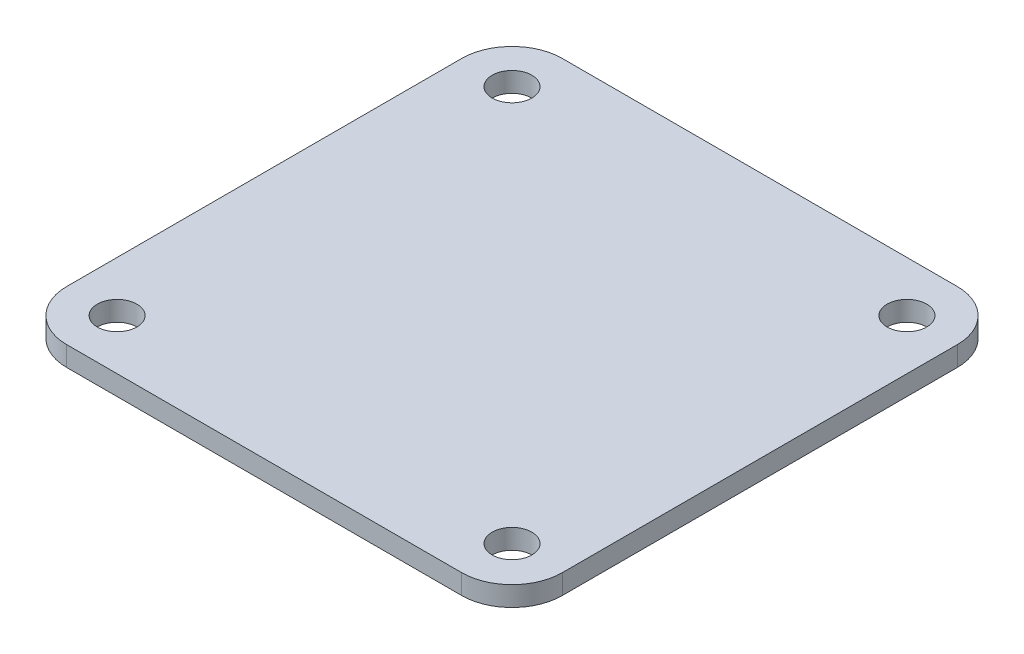
ISO-10303-21;
HEADER;
FILE_DESCRIPTION(('STEP AP214'),'2;1');
FILE_NAME('part.step','',(''),(''),'','','');
FILE_SCHEMA(('AUTOMOTIVE_DESIGN { 1 0 10303 214 1 1 1 1 }'));
ENDSEC;
DATA;
#1=APPLICATION_CONTEXT('core data for automotive mechanical design processes');
#2=APPLICATION_PROTOCOL_DEFINITION('international standard','automotive_design',2000,#1);
#3=PRODUCT_CONTEXT('',#1,'mechanical');
#4=PRODUCT('Part','Part','',(#3));
#5=PRODUCT_RELATED_PRODUCT_CATEGORY('part','',(#4));
#6=PRODUCT_DEFINITION_FORMATION('','',#4);
#7=PRODUCT_DEFINITION_CONTEXT('part definition',#1,'design');
#8=PRODUCT_DEFINITION('design','',#6,#7);
#9=PRODUCT_DEFINITION_SHAPE('','',#8);
#10=(LENGTH_UNIT() NAMED_UNIT(*) SI_UNIT(.MILLI.,.METRE.));
#11=(NAMED_UNIT(*) PLANE_ANGLE_UNIT() SI_UNIT($,.RADIAN.));
#12=(NAMED_UNIT(*) SI_UNIT($,.STERADIAN.) SOLID_ANGLE_UNIT());
#13=UNCERTAINTY_MEASURE_WITH_UNIT(LENGTH_MEASURE(1.E-05),#10,'distance_accuracy_value','');
#14=(GEOMETRIC_REPRESENTATION_CONTEXT(3) GLOBAL_UNCERTAINTY_ASSIGNED_CONTEXT((#13)) GLOBAL_UNIT_ASSIGNED_CONTEXT((#10,
#11,#12)) REPRESENTATION_CONTEXT('',''));
#15=CARTESIAN_POINT('',(0.,0.,0.));
#16=DIRECTION('',(0.,0.,1.));
#17=DIRECTION('',(1.,0.,0.));
#18=AXIS2_PLACEMENT_3D('',#15,#16,#17);
#19=CARTESIAN_POINT('',(-9.96,1.,9.96));
#20=DIRECTION('',(0.,-1.,0.));
#21=DIRECTION('',(0.,0.,-1.));
#22=AXIS2_PLACEMENT_3D('',#19,#20,#21);
#23=PLANE('',#22);
#24=CARTESIAN_POINT('',(-9.96,1.,9.96));
#25=DIRECTION('',(0.,1.,0.));
#26=DIRECTION('',(0.,0.,-1.));
#27=AXIS2_PLACEMENT_3D('',#24,#25,#26);
#28=CIRCLE('',#27,2.54);
#29=CARTESIAN_POINT('',(-12.5,1.,9.95999999999998));
#30=VERTEX_POINT('',#29);
#31=CARTESIAN_POINT('',(-9.95999999999998,1.,12.5));
#32=VERTEX_POINT('',#31);
#33=EDGE_CURVE('E170',#30,#32,#28,.T.);
#34=ORIENTED_EDGE('',*,*,#33,.T.);
#35=DIRECTION('',(1.,0.,0.));
#36=VECTOR('',#35,1.);
#37=CARTESIAN_POINT('',(-9.95999999999998,1.,12.5));
#38=LINE('',#37,#36);
#39=CARTESIAN_POINT('',(9.95999999999998,1.,12.5));
#40=VERTEX_POINT('',#39);
#41=EDGE_CURVE('E106',#32,#40,#38,.T.);
#42=ORIENTED_EDGE('',*,*,#41,.T.);
#43=CARTESIAN_POINT('',(9.96,1.,9.96));
#44=DIRECTION('',(0.,1.,0.));
#45=DIRECTION('',(0.,0.,1.));
#46=AXIS2_PLACEMENT_3D('',#43,#44,#45);
#47=CIRCLE('',#46,2.54);
#48=CARTESIAN_POINT('',(12.5,1.,9.95999999999998));
#49=VERTEX_POINT('',#48);
#50=EDGE_CURVE('E191',#40,#49,#47,.T.);
#51=ORIENTED_EDGE('',*,*,#50,.T.);
#52=DIRECTION('',(0.,0.,-1.));
#53=VECTOR('',#52,1.);
#54=CARTESIAN_POINT('',(12.5,1.,9.95999999999998));
#55=LINE('',#54,#53);
#56=CARTESIAN_POINT('',(12.5,1.,-9.95999999999998));
#57=VERTEX_POINT('',#56);
#58=EDGE_CURVE('E205',#49,#57,#55,.T.);
#59=ORIENTED_EDGE('',*,*,#58,.T.);
#60=CARTESIAN_POINT('',(9.96,1.,-9.96));
#61=DIRECTION('',(0.,1.,0.));
#62=DIRECTION('',(0.,0.,-1.));
#63=AXIS2_PLACEMENT_3D('',#60,#61,#62);
#64=CIRCLE('',#63,2.54);
#65=CARTESIAN_POINT('',(9.95999999999999,1.,-12.5));
#66=VERTEX_POINT('',#65);
#67=EDGE_CURVE('E125',#57,#66,#64,.T.);
#68=ORIENTED_EDGE('',*,*,#67,.T.);
#69=DIRECTION('',(-1.,0.,0.));
#70=VECTOR('',#69,1.);
#71=CARTESIAN_POINT('',(-9.95999999999998,1.,-12.5));
#72=LINE('',#71,#70);
#73=CARTESIAN_POINT('',(-9.95999999999998,1.,-12.5));
#74=VERTEX_POINT('',#73);
#75=EDGE_CURVE('E119',#66,#74,#72,.T.);
#76=ORIENTED_EDGE('',*,*,#75,.T.);
#77=CARTESIAN_POINT('',(-9.96,1.,-9.96));
#78=DIRECTION('',(0.,1.,0.));
#79=DIRECTION('',(0.,0.,-1.));
#80=AXIS2_PLACEMENT_3D('',#77,#78,#79);
#81=CIRCLE('',#80,2.54);
#82=CARTESIAN_POINT('',(-12.5,1.,-9.95999999999998));
#83=VERTEX_POINT('',#82);
#84=EDGE_CURVE('E123',#74,#83,#81,.T.);
#85=ORIENTED_EDGE('',*,*,#84,.T.);
#86=DIRECTION('',(0.,0.,1.));
#87=VECTOR('',#86,1.);
#88=CARTESIAN_POINT('',(-12.5,1.,9.95999999999998));
#89=LINE('',#88,#87);
#90=EDGE_CURVE('E63',#83,#30,#89,.T.);
#91=ORIENTED_EDGE('',*,*,#90,.T.);
#92=EDGE_LOOP('',(#34,#42,#51,#59,#68,#76,#85,#91));
#93=FACE_BOUND('',#92,.T.);
#94=CARTESIAN_POINT('',(-10.,1.,-10.));
#95=DIRECTION('',(0.,1.,0.));
#96=DIRECTION('',(0.,0.,1.));
#97=AXIS2_PLACEMENT_3D('',#94,#95,#96);
#98=CIRCLE('',#97,1.);
#99=CARTESIAN_POINT('',(-10.,1.,-9.));
#100=VERTEX_POINT('',#99);
#101=EDGE_CURVE('E152',#100,#100,#98,.T.);
#102=ORIENTED_EDGE('',*,*,#101,.F.);
#103=EDGE_LOOP('',(#102));
#104=FACE_BOUND('',#103,.T.);
#105=CARTESIAN_POINT('',(9.96,1.,-9.96));
#106=DIRECTION('',(0.,1.,0.));
#107=DIRECTION('',(0.,0.,1.));
#108=AXIS2_PLACEMENT_3D('',#105,#106,#107);
#109=CIRCLE('',#108,1.);
#110=CARTESIAN_POINT('',(9.96,1.,-8.96));
#111=VERTEX_POINT('',#110);
#112=EDGE_CURVE('E219',#111,#111,#109,.T.);
#113=ORIENTED_EDGE('',*,*,#112,.F.);
#114=EDGE_LOOP('',(#113));
#115=FACE_BOUND('',#114,.T.);
#116=CARTESIAN_POINT('',(9.96,1.,9.96));
#117=DIRECTION('',(0.,1.,0.));
#118=DIRECTION('',(0.,0.,1.));
#119=AXIS2_PLACEMENT_3D('',#116,#117,#118);
#120=CIRCLE('',#119,1.);
#121=CARTESIAN_POINT('',(9.96,1.,10.96));
#122=VERTEX_POINT('',#121);
#123=EDGE_CURVE('E227',#122,#122,#120,.T.);
#124=ORIENTED_EDGE('',*,*,#123,.F.);
#125=EDGE_LOOP('',(#124));
#126=FACE_BOUND('',#125,.T.);
#127=CARTESIAN_POINT('',(-9.96,1.,9.96));
#128=DIRECTION('',(0.,1.,0.));
#129=DIRECTION('',(0.,0.,1.));
#130=AXIS2_PLACEMENT_3D('',#127,#128,#129);
#131=CIRCLE('',#130,1.);
#132=CARTESIAN_POINT('',(-9.96,1.,10.96));
#133=VERTEX_POINT('',#132);
#134=EDGE_CURVE('E235',#133,#133,#131,.T.);
#135=ORIENTED_EDGE('',*,*,#134,.F.);
#136=EDGE_LOOP('',(#135));
#137=FACE_BOUND('',#136,.T.);
#138=ADVANCED_FACE('F45',(#93,#104,#115,#126,#137),#23,.F.);
#139=CARTESIAN_POINT('',(-9.96,0.,9.96));
#140=DIRECTION('',(0.,-1.,0.));
#141=DIRECTION('',(0.,0.,-1.));
#142=AXIS2_PLACEMENT_3D('',#139,#140,#141);
#143=PLANE('',#142);
#144=CARTESIAN_POINT('',(9.96,0.,9.96));
#145=DIRECTION('',(0.,1.,0.));
#146=DIRECTION('',(0.,0.,1.));
#147=AXIS2_PLACEMENT_3D('',#144,#145,#146);
#148=CIRCLE('',#147,1.);
#149=CARTESIAN_POINT('',(9.96,0.,10.96));
#150=VERTEX_POINT('',#149);
#151=EDGE_CURVE('E231',#150,#150,#148,.T.);
#152=ORIENTED_EDGE('',*,*,#151,.T.);
#153=EDGE_LOOP('',(#152));
#154=FACE_BOUND('',#153,.T.);
#155=CARTESIAN_POINT('',(-10.,0.,-10.));
#156=DIRECTION('',(0.,1.,0.));
#157=DIRECTION('',(0.,0.,1.));
#158=AXIS2_PLACEMENT_3D('',#155,#156,#157);
#159=CIRCLE('',#158,1.);
#160=CARTESIAN_POINT('',(-10.,0.,-9.));
#161=VERTEX_POINT('',#160);
#162=EDGE_CURVE('E215',#161,#161,#159,.T.);
#163=ORIENTED_EDGE('',*,*,#162,.T.);
#164=EDGE_LOOP('',(#163));
#165=FACE_BOUND('',#164,.T.);
#166=CARTESIAN_POINT('',(-9.96,0.,9.96));
#167=DIRECTION('',(0.,1.,0.));
#168=DIRECTION('',(0.,0.,-1.));
#169=AXIS2_PLACEMENT_3D('',#166,#167,#168);
#170=CIRCLE('',#169,2.54);
#171=CARTESIAN_POINT('',(-12.5,0.,9.95999999999998));
#172=VERTEX_POINT('',#171);
#173=CARTESIAN_POINT('',(-9.95999999999998,0.,12.5));
#174=VERTEX_POINT('',#173);
#175=EDGE_CURVE('E147',#172,#174,#170,.T.);
#176=ORIENTED_EDGE('',*,*,#175,.F.);
#177=DIRECTION('',(0.,0.,1.));
#178=VECTOR('',#177,1.);
#179=CARTESIAN_POINT('',(-12.5,0.,9.95999999999998));
#180=LINE('',#179,#178);
#181=CARTESIAN_POINT('',(-12.5,0.,-9.95999999999998));
#182=VERTEX_POINT('',#181);
#183=EDGE_CURVE('E98',#182,#172,#180,.T.);
#184=ORIENTED_EDGE('',*,*,#183,.F.);
#185=CARTESIAN_POINT('',(-9.96,0.,-9.96));
#186=DIRECTION('',(0.,1.,0.));
#187=DIRECTION('',(0.,0.,-1.));
#188=AXIS2_PLACEMENT_3D('',#185,#186,#187);
#189=CIRCLE('',#188,2.54);
#190=CARTESIAN_POINT('',(-9.95999999999998,0.,-12.5));
#191=VERTEX_POINT('',#190);
#192=EDGE_CURVE('E92',#191,#182,#189,.T.);
#193=ORIENTED_EDGE('',*,*,#192,.F.);
#194=DIRECTION('',(-1.,0.,0.));
#195=VECTOR('',#194,1.);
#196=CARTESIAN_POINT('',(-9.95999999999998,0.,-12.5));
#197=LINE('',#196,#195);
#198=CARTESIAN_POINT('',(9.95999999999999,0.,-12.5));
#199=VERTEX_POINT('',#198);
#200=EDGE_CURVE('E134',#199,#191,#197,.T.);
#201=ORIENTED_EDGE('',*,*,#200,.F.);
#202=CARTESIAN_POINT('',(9.96,0.,-9.96));
#203=DIRECTION('',(0.,1.,0.));
#204=DIRECTION('',(0.,0.,-1.));
#205=AXIS2_PLACEMENT_3D('',#202,#203,#204);
#206=CIRCLE('',#205,2.54);
#207=CARTESIAN_POINT('',(12.5,0.,-9.95999999999998));
#208=VERTEX_POINT('',#207);
#209=EDGE_CURVE('E161',#208,#199,#206,.T.);
#210=ORIENTED_EDGE('',*,*,#209,.F.);
#211=DIRECTION('',(0.,0.,-1.));
#212=VECTOR('',#211,1.);
#213=CARTESIAN_POINT('',(12.5,0.,9.95999999999998));
#214=LINE('',#213,#212);
#215=CARTESIAN_POINT('',(12.5,0.,9.95999999999998));
#216=VERTEX_POINT('',#215);
#217=EDGE_CURVE('E158',#216,#208,#214,.T.);
#218=ORIENTED_EDGE('',*,*,#217,.F.);
#219=CARTESIAN_POINT('',(9.96,0.,9.96));
#220=DIRECTION('',(0.,1.,0.));
#221=DIRECTION('',(0.,0.,1.));
#222=AXIS2_PLACEMENT_3D('',#219,#220,#221);
#223=CIRCLE('',#222,2.54);
#224=CARTESIAN_POINT('',(9.95999999999998,0.,12.5));
#225=VERTEX_POINT('',#224);
#226=EDGE_CURVE('E155',#225,#216,#223,.T.);
#227=ORIENTED_EDGE('',*,*,#226,.F.);
#228=DIRECTION('',(1.,0.,0.));
#229=VECTOR('',#228,1.);
#230=CARTESIAN_POINT('',(-9.95999999999998,0.,12.5));
#231=LINE('',#230,#229);
#232=EDGE_CURVE('E151',#174,#225,#231,.T.);
#233=ORIENTED_EDGE('',*,*,#232,.F.);
#234=EDGE_LOOP('',(#176,#184,#193,#201,#210,#218,#227,#233));
#235=FACE_BOUND('',#234,.T.);
#236=CARTESIAN_POINT('',(9.96,0.,-9.96));
#237=DIRECTION('',(0.,1.,0.));
#238=DIRECTION('',(0.,0.,1.));
#239=AXIS2_PLACEMENT_3D('',#236,#237,#238);
#240=CIRCLE('',#239,1.);
#241=CARTESIAN_POINT('',(9.96,0.,-8.96));
#242=VERTEX_POINT('',#241);
#243=EDGE_CURVE('E223',#242,#242,#240,.T.);
#244=ORIENTED_EDGE('',*,*,#243,.T.);
#245=EDGE_LOOP('',(#244));
#246=FACE_BOUND('',#245,.T.);
#247=CARTESIAN_POINT('',(-9.96,0.,9.96));
#248=DIRECTION('',(0.,1.,0.));
#249=DIRECTION('',(0.,0.,1.));
#250=AXIS2_PLACEMENT_3D('',#247,#248,#249);
#251=CIRCLE('',#250,1.);
#252=CARTESIAN_POINT('',(-9.96,0.,10.96));
#253=VERTEX_POINT('',#252);
#254=EDGE_CURVE('E239',#253,#253,#251,.T.);
#255=ORIENTED_EDGE('',*,*,#254,.T.);
#256=EDGE_LOOP('',(#255));
#257=FACE_BOUND('',#256,.T.);
#258=ADVANCED_FACE('F195',(#154,#165,#235,#246,#257),#143,.T.);
#259=CARTESIAN_POINT('',(-9.96,1.,9.96));
#260=DIRECTION('',(0.,-1.,0.));
#261=DIRECTION('',(0.,0.,-1.));
#262=AXIS2_PLACEMENT_3D('',#259,#260,#261);
#263=CYLINDRICAL_SURFACE('',#262,2.54);
#264=ORIENTED_EDGE('',*,*,#175,.T.);
#265=DIRECTION('',(0.,-1.,0.));
#266=VECTOR('',#265,1.);
#267=CARTESIAN_POINT('',(-9.95999999999998,1.,12.5));
#268=LINE('',#267,#266);
#269=EDGE_CURVE('E11',#32,#174,#268,.T.);
#270=ORIENTED_EDGE('',*,*,#269,.F.);
#271=ORIENTED_EDGE('',*,*,#33,.F.);
#272=DIRECTION('',(0.,-1.,0.));
#273=VECTOR('',#272,1.);
#274=CARTESIAN_POINT('',(-12.5,1.,9.95999999999998));
#275=LINE('',#274,#273);
#276=EDGE_CURVE('E143',#30,#172,#275,.T.);
#277=ORIENTED_EDGE('',*,*,#276,.T.);
#278=EDGE_LOOP('',(#264,#270,#271,#277));
#279=FACE_BOUND('',#278,.T.);
#280=ADVANCED_FACE('F47',(#279),#263,.T.);
#281=CARTESIAN_POINT('',(-9.95999999999998,1.,12.5));
#282=DIRECTION('',(0.,0.,-1.));
#283=DIRECTION('',(-1.,0.,0.));
#284=AXIS2_PLACEMENT_3D('',#281,#282,#283);
#285=PLANE('',#284);
#286=ORIENTED_EDGE('',*,*,#232,.T.);
#287=DIRECTION('',(0.,-1.,0.));
#288=VECTOR('',#287,1.);
#289=CARTESIAN_POINT('',(9.95999999999998,1.,12.5));
#290=LINE('',#289,#288);
#291=EDGE_CURVE('E55',#40,#225,#290,.T.);
#292=ORIENTED_EDGE('',*,*,#291,.F.);
#293=ORIENTED_EDGE('',*,*,#41,.F.);
#294=ORIENTED_EDGE('',*,*,#269,.T.);
#295=EDGE_LOOP('',(#286,#292,#293,#294));
#296=FACE_BOUND('',#295,.T.);
#297=ADVANCED_FACE('F273',(#296),#285,.F.);
#298=CARTESIAN_POINT('',(9.96,1.,9.96));
#299=DIRECTION('',(0.,-1.,0.));
#300=DIRECTION('',(0.,0.,-1.));
#301=AXIS2_PLACEMENT_3D('',#298,#299,#300);
#302=CYLINDRICAL_SURFACE('',#301,2.54);
#303=ORIENTED_EDGE('',*,*,#226,.T.);
#304=DIRECTION('',(0.,-1.,0.));
#305=VECTOR('',#304,1.);
#306=CARTESIAN_POINT('',(12.5,1.,9.95999999999998));
#307=LINE('',#306,#305);
#308=EDGE_CURVE('E181',#49,#216,#307,.T.);
#309=ORIENTED_EDGE('',*,*,#308,.F.);
#310=ORIENTED_EDGE('',*,*,#50,.F.);
#311=ORIENTED_EDGE('',*,*,#291,.T.);
#312=EDGE_LOOP('',(#303,#309,#310,#311));
#313=FACE_BOUND('',#312,.T.);
#314=ADVANCED_FACE('F189',(#313),#302,.T.);
#315=CARTESIAN_POINT('',(12.5,1.,9.95999999999998));
#316=DIRECTION('',(-1.,0.,0.));
#317=DIRECTION('',(0.,0.,1.));
#318=AXIS2_PLACEMENT_3D('',#315,#316,#317);
#319=PLANE('',#318);
#320=ORIENTED_EDGE('',*,*,#217,.T.);
#321=DIRECTION('',(0.,-1.,0.));
#322=VECTOR('',#321,1.);
#323=CARTESIAN_POINT('',(12.5,1.,-9.95999999999998));
#324=LINE('',#323,#322);
#325=EDGE_CURVE('E177',#57,#208,#324,.T.);
#326=ORIENTED_EDGE('',*,*,#325,.F.);
#327=ORIENTED_EDGE('',*,*,#58,.F.);
#328=ORIENTED_EDGE('',*,*,#308,.T.);
#329=EDGE_LOOP('',(#320,#326,#327,#328));
#330=FACE_BOUND('',#329,.T.);
#331=ADVANCED_FACE('F200',(#330),#319,.F.);
#332=CARTESIAN_POINT('',(9.96,1.,-9.96));
#333=DIRECTION('',(0.,-1.,0.));
#334=DIRECTION('',(0.,0.,-1.));
#335=AXIS2_PLACEMENT_3D('',#332,#333,#334);
#336=CYLINDRICAL_SURFACE('',#335,2.54);
#337=ORIENTED_EDGE('',*,*,#209,.T.);
#338=DIRECTION('',(0.,-1.,0.));
#339=VECTOR('',#338,1.);
#340=CARTESIAN_POINT('',(9.95999999999999,1.,-12.5));
#341=LINE('',#340,#339);
#342=EDGE_CURVE('E136',#66,#199,#341,.T.);
#343=ORIENTED_EDGE('',*,*,#342,.F.);
#344=ORIENTED_EDGE('',*,*,#67,.F.);
#345=ORIENTED_EDGE('',*,*,#325,.T.);
#346=EDGE_LOOP('',(#337,#343,#344,#345));
#347=FACE_BOUND('',#346,.T.);
#348=ADVANCED_FACE('F203',(#347),#336,.T.);
#349=CARTESIAN_POINT('',(-9.95999999999998,1.,-12.5));
#350=DIRECTION('',(0.,0.,1.));
#351=DIRECTION('',(1.,0.,0.));
#352=AXIS2_PLACEMENT_3D('',#349,#350,#351);
#353=PLANE('',#352);
#354=ORIENTED_EDGE('',*,*,#200,.T.);
#355=DIRECTION('',(0.,-1.,0.));
#356=VECTOR('',#355,1.);
#357=CARTESIAN_POINT('',(-9.95999999999998,1.,-12.5));
#358=LINE('',#357,#356);
#359=EDGE_CURVE('E131',#74,#191,#358,.T.);
#360=ORIENTED_EDGE('',*,*,#359,.F.);
#361=ORIENTED_EDGE('',*,*,#75,.F.);
#362=ORIENTED_EDGE('',*,*,#342,.T.);
#363=EDGE_LOOP('',(#354,#360,#361,#362));
#364=FACE_BOUND('',#363,.T.);
#365=ADVANCED_FACE('F132',(#364),#353,.F.);
#366=CARTESIAN_POINT('',(-9.96,1.,-9.96));
#367=DIRECTION('',(0.,-1.,0.));
#368=DIRECTION('',(0.,0.,-1.));
#369=AXIS2_PLACEMENT_3D('',#366,#367,#368);
#370=CYLINDRICAL_SURFACE('',#369,2.54);
#371=ORIENTED_EDGE('',*,*,#192,.T.);
#372=DIRECTION('',(0.,-1.,0.));
#373=VECTOR('',#372,1.);
#374=CARTESIAN_POINT('',(-12.5,1.,-9.95999999999998));
#375=LINE('',#374,#373);
#376=EDGE_CURVE('E137',#83,#182,#375,.T.);
#377=ORIENTED_EDGE('',*,*,#376,.F.);
#378=ORIENTED_EDGE('',*,*,#84,.F.);
#379=ORIENTED_EDGE('',*,*,#359,.T.);
#380=EDGE_LOOP('',(#371,#377,#378,#379));
#381=FACE_BOUND('',#380,.T.);
#382=ADVANCED_FACE('F139',(#381),#370,.T.);
#383=CARTESIAN_POINT('',(-12.5,1.,9.95999999999998));
#384=DIRECTION('',(1.,0.,0.));
#385=DIRECTION('',(0.,0.,-1.));
#386=AXIS2_PLACEMENT_3D('',#383,#384,#385);
#387=PLANE('',#386);
#388=ORIENTED_EDGE('',*,*,#183,.T.);
#389=ORIENTED_EDGE('',*,*,#276,.F.);
#390=ORIENTED_EDGE('',*,*,#90,.F.);
#391=ORIENTED_EDGE('',*,*,#376,.T.);
#392=EDGE_LOOP('',(#388,#389,#390,#391));
#393=FACE_BOUND('',#392,.T.);
#394=ADVANCED_FACE('F261',(#393),#387,.F.);
#395=CARTESIAN_POINT('',(-10.,1.,-10.));
#396=DIRECTION('',(0.,-1.,0.));
#397=DIRECTION('',(0.,0.,-1.));
#398=AXIS2_PLACEMENT_3D('',#395,#396,#397);
#399=CYLINDRICAL_SURFACE('',#398,1.);
#400=ORIENTED_EDGE('',*,*,#101,.T.);
#401=EDGE_LOOP('',(#400));
#402=FACE_BOUND('',#401,.T.);
#403=ORIENTED_EDGE('',*,*,#162,.F.);
#404=EDGE_LOOP('',(#403));
#405=FACE_BOUND('',#404,.T.);
#406=ADVANCED_FACE('F258',(#402,#405),#399,.F.);
#407=CARTESIAN_POINT('',(9.96,1.,-9.96));
#408=DIRECTION('',(0.,-1.,0.));
#409=DIRECTION('',(0.,0.,-1.));
#410=AXIS2_PLACEMENT_3D('',#407,#408,#409);
#411=CYLINDRICAL_SURFACE('',#410,1.);
#412=ORIENTED_EDGE('',*,*,#112,.T.);
#413=EDGE_LOOP('',(#412));
#414=FACE_BOUND('',#413,.T.);
#415=ORIENTED_EDGE('',*,*,#243,.F.);
#416=EDGE_LOOP('',(#415));
#417=FACE_BOUND('',#416,.T.);
#418=ADVANCED_FACE('F336',(#414,#417),#411,.F.);
#419=CARTESIAN_POINT('',(9.96,1.,9.96));
#420=DIRECTION('',(0.,-1.,0.));
#421=DIRECTION('',(0.,0.,-1.));
#422=AXIS2_PLACEMENT_3D('',#419,#420,#421);
#423=CYLINDRICAL_SURFACE('',#422,1.);
#424=ORIENTED_EDGE('',*,*,#123,.T.);
#425=EDGE_LOOP('',(#424));
#426=FACE_BOUND('',#425,.T.);
#427=ORIENTED_EDGE('',*,*,#151,.F.);
#428=EDGE_LOOP('',(#427));
#429=FACE_BOUND('',#428,.T.);
#430=ADVANCED_FACE('F344',(#426,#429),#423,.F.);
#431=CARTESIAN_POINT('',(-9.96,1.,9.96));
#432=DIRECTION('',(0.,-1.,0.));
#433=DIRECTION('',(0.,0.,-1.));
#434=AXIS2_PLACEMENT_3D('',#431,#432,#433);
#435=CYLINDRICAL_SURFACE('',#434,1.);
#436=ORIENTED_EDGE('',*,*,#134,.T.);
#437=EDGE_LOOP('',(#436));
#438=FACE_BOUND('',#437,.T.);
#439=ORIENTED_EDGE('',*,*,#254,.F.);
#440=EDGE_LOOP('',(#439));
#441=FACE_BOUND('',#440,.T.);
#442=ADVANCED_FACE('F247',(#438,#441),#435,.F.);
#443=CLOSED_SHELL('',(#138,#258,#280,#297,#314,#331,#348,#365,#382,#394,#406,#418,#430,#442));
#444=MANIFOLD_SOLID_BREP('B2',#443);
#445=ADVANCED_BREP_SHAPE_REPRESENTATION('',(#18,#444),#14);
#446=SHAPE_DEFINITION_REPRESENTATION(#9,#445);
ENDSEC;
END-ISO-10303-21;
